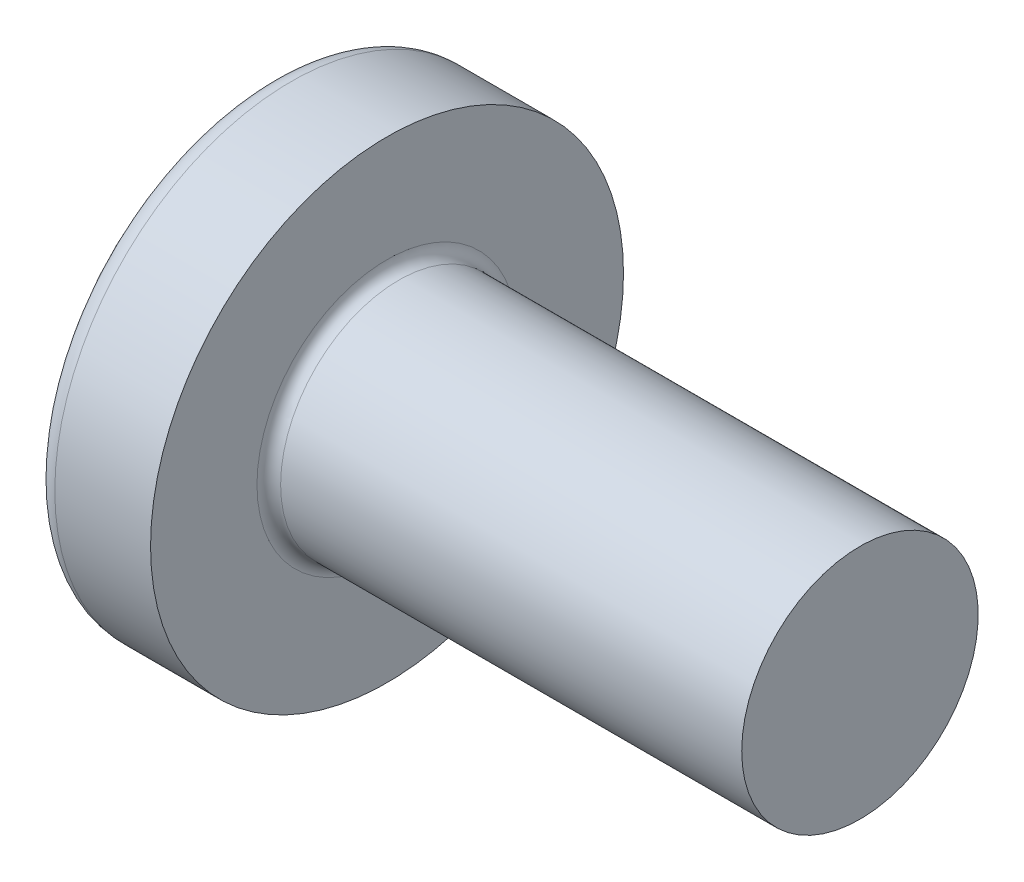
ISO-10303-21;
HEADER;
FILE_DESCRIPTION(('STEP AP214'),'2;1');
FILE_NAME('part.step','',(''),(''),'','','');
FILE_SCHEMA(('AUTOMOTIVE_DESIGN { 1 0 10303 214 1 1 1 1 }'));
ENDSEC;
DATA;
#1=APPLICATION_CONTEXT('core data for automotive mechanical design processes');
#2=APPLICATION_PROTOCOL_DEFINITION('international standard','automotive_design',2000,#1);
#3=PRODUCT_CONTEXT('',#1,'mechanical');
#4=PRODUCT('Part','Part','',(#3));
#5=PRODUCT_RELATED_PRODUCT_CATEGORY('part','',(#4));
#6=PRODUCT_DEFINITION_FORMATION('','',#4);
#7=PRODUCT_DEFINITION_CONTEXT('part definition',#1,'design');
#8=PRODUCT_DEFINITION('design','',#6,#7);
#9=PRODUCT_DEFINITION_SHAPE('','',#8);
#10=(LENGTH_UNIT() NAMED_UNIT(*) SI_UNIT(.MILLI.,.METRE.));
#11=(NAMED_UNIT(*) PLANE_ANGLE_UNIT() SI_UNIT($,.RADIAN.));
#12=(NAMED_UNIT(*) SI_UNIT($,.STERADIAN.) SOLID_ANGLE_UNIT());
#13=UNCERTAINTY_MEASURE_WITH_UNIT(LENGTH_MEASURE(1.E-05),#10,'distance_accuracy_value','');
#14=(GEOMETRIC_REPRESENTATION_CONTEXT(3) GLOBAL_UNCERTAINTY_ASSIGNED_CONTEXT((#13)) GLOBAL_UNIT_ASSIGNED_CONTEXT((#10,
#11,#12)) REPRESENTATION_CONTEXT('',''));
#15=CARTESIAN_POINT('',(0.,0.,0.));
#16=DIRECTION('',(0.,0.,1.));
#17=DIRECTION('',(1.,0.,0.));
#18=AXIS2_PLACEMENT_3D('',#15,#16,#17);
#19=CARTESIAN_POINT('',(-998.464491047989,0.,0.));
#20=DIRECTION('',(-1.,0.,0.));
#21=DIRECTION('',(0.,0.,1.));
#22=AXIS2_PLACEMENT_3D('',#19,#20,#21);
#23=CONICAL_SURFACE('',#22,3077.68353717531,1.25663706143592);
#24=CARTESIAN_POINT('',(1.42,0.,0.));
#25=DIRECTION('',(-1.,0.,0.));
#26=DIRECTION('',(0.,0.,1.));
#27=AXIS2_PLACEMENT_3D('',#24,#25,#26);
#28=CIRCLE('',#27,0.3555);
#29=CARTESIAN_POINT('',(1.42,-0.096987179996118,0.342014234961647));
#30=VERTEX_POINT('',#29);
#31=CARTESIAN_POINT('',(1.42,0.0969871799961156,0.342014234961648));
#32=VERTEX_POINT('',#31);
#33=EDGE_CURVE('E331',#30,#32,#28,.T.);
#34=ORIENTED_EDGE('',*,*,#33,.T.);
#35=CARTESIAN_POINT('',(1.42,0.,0.));
#36=DIRECTION('',(-1.,0.,0.));
#37=DIRECTION('',(0.,0.,1.));
#38=AXIS2_PLACEMENT_3D('',#35,#36,#37);
#39=CIRCLE('',#38,0.3555);
#40=CARTESIAN_POINT('',(1.42,0.239999999999999,0.26225989018529));
#41=VERTEX_POINT('',#40);
#42=EDGE_CURVE('E173',#32,#41,#39,.T.);
#43=ORIENTED_EDGE('',*,*,#42,.T.);
#44=CARTESIAN_POINT('',(1.42,0.,0.));
#45=DIRECTION('',(-1.,0.,0.));
#46=DIRECTION('',(0.,0.,1.));
#47=AXIS2_PLACEMENT_3D('',#44,#45,#46);
#48=CIRCLE('',#47,0.3555);
#49=CARTESIAN_POINT('',(1.42,0.262259890185289,0.24));
#50=VERTEX_POINT('',#49);
#51=EDGE_CURVE('E337',#41,#50,#48,.T.);
#52=ORIENTED_EDGE('',*,*,#51,.T.);
#53=CARTESIAN_POINT('',(1.42,0.,0.));
#54=DIRECTION('',(-1.,0.,0.));
#55=DIRECTION('',(0.,0.,1.));
#56=AXIS2_PLACEMENT_3D('',#53,#54,#55);
#57=CIRCLE('',#56,0.3555);
#58=CARTESIAN_POINT('',(1.42,0.342014234961648,0.0969871799961127));
#59=VERTEX_POINT('',#58);
#60=EDGE_CURVE('E366',#50,#59,#57,.T.);
#61=ORIENTED_EDGE('',*,*,#60,.T.);
#62=CARTESIAN_POINT('',(1.42,0.,0.));
#63=DIRECTION('',(-1.,0.,0.));
#64=DIRECTION('',(0.,0.,1.));
#65=AXIS2_PLACEMENT_3D('',#62,#63,#64);
#66=CIRCLE('',#65,0.3555);
#67=CARTESIAN_POINT('',(1.42,0.342014234961648,-0.0969871799961128));
#68=VERTEX_POINT('',#67);
#69=EDGE_CURVE('E371',#59,#68,#66,.T.);
#70=ORIENTED_EDGE('',*,*,#69,.T.);
#71=CARTESIAN_POINT('',(1.42,0.,0.));
#72=DIRECTION('',(-1.,0.,0.));
#73=DIRECTION('',(0.,0.,1.));
#74=AXIS2_PLACEMENT_3D('',#71,#72,#73);
#75=CIRCLE('',#74,0.3555);
#76=CARTESIAN_POINT('',(1.42,0.262259890185289,-0.24));
#77=VERTEX_POINT('',#76);
#78=EDGE_CURVE('E381',#68,#77,#75,.T.);
#79=ORIENTED_EDGE('',*,*,#78,.T.);
#80=CARTESIAN_POINT('',(1.42,0.,0.));
#81=DIRECTION('',(-1.,0.,0.));
#82=DIRECTION('',(0.,0.,1.));
#83=AXIS2_PLACEMENT_3D('',#80,#81,#82);
#84=CIRCLE('',#83,0.3555);
#85=CARTESIAN_POINT('',(1.42,0.240000000000001,-0.262259890185288));
#86=VERTEX_POINT('',#85);
#87=EDGE_CURVE('E323',#77,#86,#84,.T.);
#88=ORIENTED_EDGE('',*,*,#87,.T.);
#89=CARTESIAN_POINT('',(1.42,0.,0.));
#90=DIRECTION('',(-1.,0.,0.));
#91=DIRECTION('',(0.,0.,1.));
#92=AXIS2_PLACEMENT_3D('',#89,#90,#91);
#93=CIRCLE('',#92,0.3555);
#94=CARTESIAN_POINT('',(1.42,0.0969871799961165,-0.342014234961647));
#95=VERTEX_POINT('',#94);
#96=EDGE_CURVE('E320',#86,#95,#93,.T.);
#97=ORIENTED_EDGE('',*,*,#96,.T.);
#98=CARTESIAN_POINT('',(1.42,0.,0.));
#99=DIRECTION('',(-1.,0.,0.));
#100=DIRECTION('',(0.,0.,1.));
#101=AXIS2_PLACEMENT_3D('',#98,#99,#100);
#102=CIRCLE('',#101,0.3555);
#103=CARTESIAN_POINT('',(1.42,-0.0969871799961141,-0.342014234961648));
#104=VERTEX_POINT('',#103);
#105=EDGE_CURVE('E11',#95,#104,#102,.T.);
#106=ORIENTED_EDGE('',*,*,#105,.T.);
#107=CARTESIAN_POINT('',(1.42,0.,0.));
#108=DIRECTION('',(-1.,0.,0.));
#109=DIRECTION('',(0.,0.,1.));
#110=AXIS2_PLACEMENT_3D('',#107,#108,#109);
#111=CIRCLE('',#110,0.3555);
#112=CARTESIAN_POINT('',(1.42,-0.239999999999999,-0.26225989018529));
#113=VERTEX_POINT('',#112);
#114=EDGE_CURVE('E33',#104,#113,#111,.T.);
#115=ORIENTED_EDGE('',*,*,#114,.T.);
#116=CARTESIAN_POINT('',(1.42,0.,0.));
#117=DIRECTION('',(-1.,0.,0.));
#118=DIRECTION('',(0.,0.,1.));
#119=AXIS2_PLACEMENT_3D('',#116,#117,#118);
#120=CIRCLE('',#119,0.3555);
#121=CARTESIAN_POINT('',(1.42,-0.262259890185289,-0.24));
#122=VERTEX_POINT('',#121);
#123=EDGE_CURVE('E185',#113,#122,#120,.T.);
#124=ORIENTED_EDGE('',*,*,#123,.T.);
#125=CARTESIAN_POINT('',(1.42,0.,0.));
#126=DIRECTION('',(-1.,0.,0.));
#127=DIRECTION('',(0.,0.,1.));
#128=AXIS2_PLACEMENT_3D('',#125,#126,#127);
#129=CIRCLE('',#128,0.3555);
#130=CARTESIAN_POINT('',(1.42,-0.342014234961649,-0.0969871799961111));
#131=VERTEX_POINT('',#130);
#132=EDGE_CURVE('E374',#122,#131,#129,.T.);
#133=ORIENTED_EDGE('',*,*,#132,.T.);
#134=CARTESIAN_POINT('',(1.42,0.,0.));
#135=DIRECTION('',(-1.,0.,0.));
#136=DIRECTION('',(0.,0.,1.));
#137=AXIS2_PLACEMENT_3D('',#134,#135,#136);
#138=CIRCLE('',#137,0.3555);
#139=CARTESIAN_POINT('',(1.42,-0.342014234961649,0.096987179996111));
#140=VERTEX_POINT('',#139);
#141=EDGE_CURVE('E348',#131,#140,#138,.T.);
#142=ORIENTED_EDGE('',*,*,#141,.T.);
#143=CARTESIAN_POINT('',(1.42,0.,0.));
#144=DIRECTION('',(-1.,0.,0.));
#145=DIRECTION('',(0.,0.,1.));
#146=AXIS2_PLACEMENT_3D('',#143,#144,#145);
#147=CIRCLE('',#146,0.3555);
#148=CARTESIAN_POINT('',(1.42,-0.262259890185289,0.24));
#149=VERTEX_POINT('',#148);
#150=EDGE_CURVE('E345',#140,#149,#147,.T.);
#151=ORIENTED_EDGE('',*,*,#150,.T.);
#152=CARTESIAN_POINT('',(1.42,0.,0.));
#153=DIRECTION('',(-1.,0.,0.));
#154=DIRECTION('',(0.,0.,1.));
#155=AXIS2_PLACEMENT_3D('',#152,#153,#154);
#156=CIRCLE('',#155,0.3555);
#157=CARTESIAN_POINT('',(1.42,-0.240000000000001,0.262259890185288));
#158=VERTEX_POINT('',#157);
#159=EDGE_CURVE('E330',#149,#158,#156,.T.);
#160=ORIENTED_EDGE('',*,*,#159,.T.);
#161=CARTESIAN_POINT('',(1.42,0.,0.));
#162=DIRECTION('',(-1.,0.,0.));
#163=DIRECTION('',(0.,0.,1.));
#164=AXIS2_PLACEMENT_3D('',#161,#162,#163);
#165=CIRCLE('',#164,0.3555);
#166=EDGE_CURVE('E327',#158,#30,#165,.T.);
#167=ORIENTED_EDGE('',*,*,#166,.T.);
#168=EDGE_LOOP('',(#34,#43,#52,#61,#70,#79,#88,#97,#106,#115,#124,#133,#142,#151,#160,#167));
#169=FACE_BOUND('',#168,.T.);
#170=CARTESIAN_POINT('',(1.5355089520108,0.,0.));
#171=VERTEX_POINT('',#170);
#172=VERTEX_LOOP('',#171);
#173=FACE_BOUND('',#172,.T.);
#174=ADVANCED_FACE('F17',(#169,#173),#23,.F.);
#175=CARTESIAN_POINT('',(1.42,0.,0.));
#176=DIRECTION('',(-1.,0.,0.));
#177=DIRECTION('',(0.,0.,1.));
#178=AXIS2_PLACEMENT_3D('',#175,#176,#177);
#179=CONICAL_SURFACE('',#178,0.3555,0.069813170079766);
#180=CARTESIAN_POINT('',(1.38853932865354,0.,0.35769994444886));
#181=CARTESIAN_POINT('',(1.38853932865354,0.0330178274849108,0.35769994444886));
#182=CARTESIAN_POINT('',(1.39911491003058,0.0656203045040143,0.352427154961573));
#183=CARTESIAN_POINT('',(1.42,0.0969871799961156,0.342014234961648));
#184=(BOUNDED_CURVE() B_SPLINE_CURVE(3,(#180,#181,#182,#183),.UNSPECIFIED.,.F.,
.F.) B_SPLINE_CURVE_WITH_KNOTS((4,4),(0.,0.317566308934627),
.UNSPECIFIED.) CURVE() GEOMETRIC_REPRESENTATION_ITEM() RATIONAL_B_SPLINE_CURVE((1.,
0.991613612050471,0.991613612050471,1.)) REPRESENTATION_ITEM(''));
#185=CARTESIAN_POINT('',(1.38853932865354,0.,0.35769994444886));
#186=VERTEX_POINT('',#185);
#187=EDGE_CURVE('E469',#186,#32,#184,.T.);
#188=ORIENTED_EDGE('',*,*,#187,.T.);
#189=ORIENTED_EDGE('',*,*,#33,.F.);
#190=CARTESIAN_POINT('',(1.42,-0.096987179996118,0.342014234961647));
#191=CARTESIAN_POINT('',(1.39911491003058,-0.0656203045040168,0.352427154961572));
#192=CARTESIAN_POINT('',(1.38853932865354,-0.0330178274849133,0.35769994444886));
#193=CARTESIAN_POINT('',(1.38853932865354,0.,0.35769994444886));
#194=(BOUNDED_CURVE() B_SPLINE_CURVE(3,(#190,#191,#192,#193),.UNSPECIFIED.,.F.,
.F.) B_SPLINE_CURVE_WITH_KNOTS((4,4),(5.96561899824496,6.28318530717959),
.UNSPECIFIED.) CURVE() GEOMETRIC_REPRESENTATION_ITEM() RATIONAL_B_SPLINE_CURVE((1.,
0.991613612050471,0.991613612050471,1.)) REPRESENTATION_ITEM(''));
#195=EDGE_CURVE('E363',#30,#186,#194,.T.);
#196=ORIENTED_EDGE('',*,*,#195,.T.);
#197=EDGE_LOOP('',(#188,#189,#196));
#198=FACE_BOUND('',#197,.T.);
#199=ADVANCED_FACE('F511',(#198),#179,.F.);
#200=CARTESIAN_POINT('',(1.7,0.,0.));
#201=DIRECTION('',(-1.,0.,0.));
#202=DIRECTION('',(0.,0.,1.));
#203=AXIS2_PLACEMENT_3D('',#200,#201,#202);
#204=TOROIDAL_SURFACE('',#203,1.1,0.1);
#205=CARTESIAN_POINT('',(1.7,0.,0.));
#206=DIRECTION('',(1.,0.,0.));
#207=DIRECTION('',(0.,0.,1.));
#208=AXIS2_PLACEMENT_3D('',#205,#206,#207);
#209=CIRCLE('',#208,1.);
#210=CARTESIAN_POINT('',(1.7,0.,1.));
#211=VERTEX_POINT('',#210);
#212=EDGE_CURVE('E188',#211,#211,#209,.T.);
#213=ORIENTED_EDGE('',*,*,#212,.F.);
#214=EDGE_LOOP('',(#213));
#215=FACE_BOUND('',#214,.T.);
#216=CARTESIAN_POINT('',(1.6,0.,0.));
#217=DIRECTION('',(-1.,0.,0.));
#218=DIRECTION('',(0.,0.,1.));
#219=AXIS2_PLACEMENT_3D('',#216,#217,#218);
#220=CIRCLE('',#219,1.1);
#221=CARTESIAN_POINT('',(1.6,0.,1.1));
#222=VERTEX_POINT('',#221);
#223=EDGE_CURVE('E193',#222,#222,#220,.T.);
#224=ORIENTED_EDGE('',*,*,#223,.F.);
#225=EDGE_LOOP('',(#224));
#226=FACE_BOUND('',#225,.T.);
#227=ADVANCED_FACE('F567',(#215,#226),#204,.F.);
#228=CARTESIAN_POINT('',(0.79002074697727,0.,0.));
#229=DIRECTION('',(-1.,0.,0.));
#230=DIRECTION('',(0.,0.,1.));
#231=AXIS2_PLACEMENT_3D('',#228,#229,#230);
#232=TOROIDAL_SURFACE('',#231,1.82,0.18);
#233=CARTESIAN_POINT('',(0.646379599446113,0.,0.));
#234=DIRECTION('',(-1.,0.,0.));
#235=DIRECTION('',(0.,0.,1.));
#236=AXIS2_PLACEMENT_3D('',#233,#234,#235);
#237=CIRCLE('',#236,1.92847682119205);
#238=CARTESIAN_POINT('',(0.646379599446113,0.,1.92847682119205));
#239=VERTEX_POINT('',#238);
#240=EDGE_CURVE('E458',#239,#239,#237,.T.);
#241=ORIENTED_EDGE('',*,*,#240,.F.);
#242=EDGE_LOOP('',(#241));
#243=FACE_BOUND('',#242,.T.);
#244=CARTESIAN_POINT('',(0.790020746977271,0.,0.));
#245=DIRECTION('',(-1.,0.,0.));
#246=DIRECTION('',(0.,0.,1.));
#247=AXIS2_PLACEMENT_3D('',#244,#245,#246);
#248=CIRCLE('',#247,2.);
#249=CARTESIAN_POINT('',(0.790020746977271,0.,2.));
#250=VERTEX_POINT('',#249);
#251=EDGE_CURVE('E465',#250,#250,#248,.T.);
#252=ORIENTED_EDGE('',*,*,#251,.T.);
#253=EDGE_LOOP('',(#252));
#254=FACE_BOUND('',#253,.T.);
#255=ADVANCED_FACE('F572',(#243,#254),#232,.T.);
#256=CARTESIAN_POINT('',(-25.4,0.,0.));
#257=DIRECTION('',(-1.,0.,0.));
#258=DIRECTION('',(0.,0.,1.));
#259=AXIS2_PLACEMENT_3D('',#256,#257,#258);
#260=CYLINDRICAL_SURFACE('',#259,2.);
#261=ORIENTED_EDGE('',*,*,#251,.F.);
#262=EDGE_LOOP('',(#261));
#263=FACE_BOUND('',#262,.T.);
#264=CARTESIAN_POINT('',(1.6,0.,0.));
#265=DIRECTION('',(-1.,0.,0.));
#266=DIRECTION('',(0.,0.,1.));
#267=AXIS2_PLACEMENT_3D('',#264,#265,#266);
#268=CIRCLE('',#267,2.);
#269=CARTESIAN_POINT('',(1.6,0.,2.));
#270=VERTEX_POINT('',#269);
#271=EDGE_CURVE('E462',#270,#270,#268,.T.);
#272=ORIENTED_EDGE('',*,*,#271,.T.);
#273=EDGE_LOOP('',(#272));
#274=FACE_BOUND('',#273,.T.);
#275=ADVANCED_FACE('F576',(#263,#274),#260,.T.);
#276=CARTESIAN_POINT('',(-25.4,0.,0.));
#277=DIRECTION('',(-1.,0.,0.));
#278=DIRECTION('',(0.,0.,1.));
#279=AXIS2_PLACEMENT_3D('',#276,#277,#278);
#280=CYLINDRICAL_SURFACE('',#279,1.);
#281=ORIENTED_EDGE('',*,*,#212,.T.);
#282=EDGE_LOOP('',(#281));
#283=FACE_BOUND('',#282,.T.);
#284=CARTESIAN_POINT('',(5.6,0.,0.));
#285=DIRECTION('',(-1.,0.,0.));
#286=DIRECTION('',(0.,0.,1.));
#287=AXIS2_PLACEMENT_3D('',#284,#285,#286);
#288=CIRCLE('',#287,1.);
#289=CARTESIAN_POINT('',(5.6,0.,1.));
#290=VERTEX_POINT('',#289);
#291=EDGE_CURVE('E459',#290,#290,#288,.T.);
#292=ORIENTED_EDGE('',*,*,#291,.T.);
#293=EDGE_LOOP('',(#292));
#294=FACE_BOUND('',#293,.T.);
#295=ADVANCED_FACE('F579',(#283,#294),#280,.T.);
#296=CARTESIAN_POINT('',(3.2,0.,0.));
#297=DIRECTION('',(0.,0.,-1.));
#298=DIRECTION('',(0.,1.,0.));
#299=AXIS2_PLACEMENT_3D('',#296,#297,#298);
#300=SPHERICAL_SURFACE('',#299,3.2);
#301=CARTESIAN_POINT('',(2.98218780828175,-0.436863744320003,0.));
#302=DIRECTION('',(0.446197753347436,0.894934391398443,0.));
#303=DIRECTION('',(-0.894934391398443,0.446197753347436,0.));
#304=AXIS2_PLACEMENT_3D('',#301,#302,#303);
#305=CIRCLE('',#304,3.16254769419176);
#306=CARTESIAN_POINT('',(0.160076673366104,0.970188728128243,-0.24));
#307=VERTEX_POINT('',#306);
#308=CARTESIAN_POINT('',(0.160076673366104,0.970188728128243,0.24));
#309=VERTEX_POINT('',#308);
#310=EDGE_CURVE('E452',#307,#309,#305,.T.);
#311=ORIENTED_EDGE('',*,*,#310,.T.);
#312=CARTESIAN_POINT('',(3.2,0.,0.24));
#313=DIRECTION('',(0.,0.,-1.));
#314=DIRECTION('',(0.,1.,0.));
#315=AXIS2_PLACEMENT_3D('',#312,#313,#314);
#316=CIRCLE('',#315,3.19098730802866);
#317=CARTESIAN_POINT('',(0.0321614467928854,0.383665089387417,0.24));
#318=VERTEX_POINT('',#317);
#319=EDGE_CURVE('E246',#318,#309,#316,.T.);
#320=ORIENTED_EDGE('',*,*,#319,.F.);
#321=CARTESIAN_POINT('',(0.0321614467928854,0.,0.));
#322=DIRECTION('',(-1.,0.,0.));
#323=DIRECTION('',(0.,0.,-1.));
#324=AXIS2_PLACEMENT_3D('',#321,#322,#323);
#325=CIRCLE('',#324,0.452547125518057);
#326=CARTESIAN_POINT('',(0.0321614467928856,0.239999999999999,0.383665089387419));
#327=VERTEX_POINT('',#326);
#328=EDGE_CURVE('E360',#327,#318,#325,.T.);
#329=ORIENTED_EDGE('',*,*,#328,.F.);
#330=CARTESIAN_POINT('',(3.2,0.24,0.));
#331=DIRECTION('',(0.,-1.,0.));
#332=DIRECTION('',(0.,0.,-1.));
#333=AXIS2_PLACEMENT_3D('',#330,#331,#332);
#334=CIRCLE('',#333,3.19098730802866);
#335=CARTESIAN_POINT('',(0.160076673366103,0.239999999999997,0.970188728128244));
#336=VERTEX_POINT('',#335);
#337=EDGE_CURVE('E271',#336,#327,#334,.T.);
#338=ORIENTED_EDGE('',*,*,#337,.F.);
#339=CARTESIAN_POINT('',(2.98218780828175,0.,-0.436863744320003));
#340=DIRECTION('',(0.446197753347436,0.,0.894934391398443));
#341=DIRECTION('',(0.894934391398443,0.,-0.446197753347436));
#342=AXIS2_PLACEMENT_3D('',#339,#340,#341);
#343=CIRCLE('',#342,3.16254769419176);
#344=CARTESIAN_POINT('',(0.160076673366103,-0.240000000000003,0.970188728128242));
#345=VERTEX_POINT('',#344);
#346=EDGE_CURVE('E387',#336,#345,#343,.T.);
#347=ORIENTED_EDGE('',*,*,#346,.T.);
#348=CARTESIAN_POINT('',(3.2,-0.24,0.));
#349=DIRECTION('',(0.,1.,0.));
#350=DIRECTION('',(0.,0.,1.));
#351=AXIS2_PLACEMENT_3D('',#348,#349,#350);
#352=CIRCLE('',#351,3.19098730802866);
#353=CARTESIAN_POINT('',(0.0321614467928854,-0.240000000000001,0.383665089387418));
#354=VERTEX_POINT('',#353);
#355=EDGE_CURVE('E324',#354,#345,#352,.T.);
#356=ORIENTED_EDGE('',*,*,#355,.F.);
#357=CARTESIAN_POINT('',(0.0321614467928854,0.,0.));
#358=DIRECTION('',(-1.,0.,0.));
#359=DIRECTION('',(0.,0.,-1.));
#360=AXIS2_PLACEMENT_3D('',#357,#358,#359);
#361=CIRCLE('',#360,0.452547125518057);
#362=CARTESIAN_POINT('',(0.0321614467928854,-0.383665089387419,0.24));
#363=VERTEX_POINT('',#362);
#364=EDGE_CURVE('E355',#363,#354,#361,.T.);
#365=ORIENTED_EDGE('',*,*,#364,.F.);
#366=CARTESIAN_POINT('',(3.2,0.,0.24));
#367=DIRECTION('',(0.,0.,-1.));
#368=DIRECTION('',(0.,1.,0.));
#369=AXIS2_PLACEMENT_3D('',#366,#367,#368);
#370=CIRCLE('',#369,3.19098730802866);
#371=CARTESIAN_POINT('',(0.160076673366103,-0.970188728128243,0.24));
#372=VERTEX_POINT('',#371);
#373=EDGE_CURVE('E351',#372,#363,#370,.T.);
#374=ORIENTED_EDGE('',*,*,#373,.F.);
#375=CARTESIAN_POINT('',(2.98218780828175,0.436863744320002,0.));
#376=DIRECTION('',(0.446197753347436,-0.894934391398443,0.));
#377=DIRECTION('',(0.894934391398443,0.446197753347436,0.));
#378=AXIS2_PLACEMENT_3D('',#375,#376,#377);
#379=CIRCLE('',#378,3.16254769419176);
#380=CARTESIAN_POINT('',(0.160076673366103,-0.970188728128243,-0.24));
#381=VERTEX_POINT('',#380);
#382=EDGE_CURVE('E456',#372,#381,#379,.T.);
#383=ORIENTED_EDGE('',*,*,#382,.T.);
#384=CARTESIAN_POINT('',(3.2,0.,-0.24));
#385=DIRECTION('',(0.,0.,1.));
#386=DIRECTION('',(1.,0.,0.));
#387=AXIS2_PLACEMENT_3D('',#384,#385,#386);
#388=CIRCLE('',#387,3.19098730802866);
#389=CARTESIAN_POINT('',(0.0321614467928855,-0.383665089387419,-0.24));
#390=VERTEX_POINT('',#389);
#391=EDGE_CURVE('E167',#390,#381,#388,.T.);
#392=ORIENTED_EDGE('',*,*,#391,.F.);
#393=CARTESIAN_POINT('',(0.0321614467928854,0.,0.));
#394=DIRECTION('',(-1.,0.,0.));
#395=DIRECTION('',(0.,0.,-1.));
#396=AXIS2_PLACEMENT_3D('',#393,#394,#395);
#397=CIRCLE('',#396,0.452547125518057);
#398=CARTESIAN_POINT('',(0.0321614467928854,-0.239999999999998,-0.38366508938742));
#399=VERTEX_POINT('',#398);
#400=EDGE_CURVE('E159',#399,#390,#397,.T.);
#401=ORIENTED_EDGE('',*,*,#400,.F.);
#402=CARTESIAN_POINT('',(3.2,-0.24,0.));
#403=DIRECTION('',(0.,1.,0.));
#404=DIRECTION('',(0.,0.,1.));
#405=AXIS2_PLACEMENT_3D('',#402,#403,#404);
#406=CIRCLE('',#405,3.19098730802866);
#407=CARTESIAN_POINT('',(0.160076673366103,-0.239999999999996,-0.970188728128244));
#408=VERTEX_POINT('',#407);
#409=EDGE_CURVE('E164',#408,#399,#406,.T.);
#410=ORIENTED_EDGE('',*,*,#409,.F.);
#411=CARTESIAN_POINT('',(2.98218780828175,0.,0.436863744320002));
#412=DIRECTION('',(0.446197753347436,0.,-0.894934391398443));
#413=DIRECTION('',(-0.894934391398443,0.,-0.446197753347436));
#414=AXIS2_PLACEMENT_3D('',#411,#412,#413);
#415=CIRCLE('',#414,3.16254769419176);
#416=CARTESIAN_POINT('',(0.160076673366103,0.240000000000003,-0.970188728128242));
#417=VERTEX_POINT('',#416);
#418=EDGE_CURVE('E454',#408,#417,#415,.T.);
#419=ORIENTED_EDGE('',*,*,#418,.T.);
#420=CARTESIAN_POINT('',(3.2,0.24,0.));
#421=DIRECTION('',(0.,-1.,0.));
#422=DIRECTION('',(0.,0.,-1.));
#423=AXIS2_PLACEMENT_3D('',#420,#421,#422);
#424=CIRCLE('',#423,3.19098730802866);
#425=CARTESIAN_POINT('',(0.0321614467928854,0.240000000000001,-0.383665089387417));
#426=VERTEX_POINT('',#425);
#427=EDGE_CURVE('E312',#426,#417,#424,.T.);
#428=ORIENTED_EDGE('',*,*,#427,.F.);
#429=CARTESIAN_POINT('',(0.0321614467928854,0.,0.));
#430=DIRECTION('',(-1.,0.,0.));
#431=DIRECTION('',(0.,0.,-1.));
#432=AXIS2_PLACEMENT_3D('',#429,#430,#431);
#433=CIRCLE('',#432,0.452547125518057);
#434=CARTESIAN_POINT('',(0.0321614467928855,0.383665089387417,-0.24));
#435=VERTEX_POINT('',#434);
#436=EDGE_CURVE('E172',#435,#426,#433,.T.);
#437=ORIENTED_EDGE('',*,*,#436,.F.);
#438=CARTESIAN_POINT('',(3.2,0.,-0.24));
#439=DIRECTION('',(0.,0.,1.));
#440=DIRECTION('',(1.,0.,0.));
#441=AXIS2_PLACEMENT_3D('',#438,#439,#440);
#442=CIRCLE('',#441,3.19098730802866);
#443=EDGE_CURVE('E206',#307,#435,#442,.T.);
#444=ORIENTED_EDGE('',*,*,#443,.F.);
#445=EDGE_LOOP('',(#311,#320,#329,#338,#347,#356,#365,#374,#383,#392,#401,#410,#419,#428,#437,#444));
#446=FACE_BOUND('',#445,.T.);
#447=ORIENTED_EDGE('',*,*,#240,.T.);
#448=EDGE_LOOP('',(#447));
#449=FACE_BOUND('',#448,.T.);
#450=ADVANCED_FACE('F161',(#446,#449),#300,.T.);
#451=CARTESIAN_POINT('',(1.42,0.342014234961647,-0.24));
#452=DIRECTION('',(0.,0.,1.));
#453=DIRECTION('',(1.,0.,0.));
#454=AXIS2_PLACEMENT_3D('',#451,#452,#453);
#455=PLANE('',#454);
#456=ORIENTED_EDGE('',*,*,#443,.T.);
#457=CARTESIAN_POINT('',(0.0321614467928856,0.383665089387419,-0.24));
#458=CARTESIAN_POINT('',(0.172697148295828,0.372064034597807,-0.24));
#459=CARTESIAN_POINT('',(0.31322263072474,0.360333952815257,-0.24));
#460=CARTESIAN_POINT('',(0.594238285905824,0.336477810254577,-0.24));
#461=CARTESIAN_POINT('',(0.734728459045723,0.32435175403485,-0.24));
#462=CARTESIAN_POINT('',(0.966019988502869,0.303945294942453,-0.24));
#463=CARTESIAN_POINT('',(1.05683500418333,0.295820311839184,-0.24));
#464=CARTESIAN_POINT('',(1.23843898471245,0.279277294107898,-0.24));
#465=CARTESIAN_POINT('',(1.32922794936196,0.270859257296756,-0.24));
#466=CARTESIAN_POINT('',(1.42000000000038,0.262259890189613,-0.24));
#467=B_SPLINE_CURVE_WITH_KNOTS('',3,(#457,#458,#459,#460,#461,#462,#463,#464,#465,#466),
.UNSPECIFIED.,.F.,.F.,(4,2,2,2,4),(0.,0.423041758824321,0.846078649367109,1.11961147507105,
1.39314633891277),.UNSPECIFIED.);
#468=EDGE_CURVE('E198',#435,#77,#467,.T.);
#469=ORIENTED_EDGE('',*,*,#468,.T.);
#470=DIRECTION('',(0.,1.,0.));
#471=VECTOR('',#470,1.);
#472=CARTESIAN_POINT('',(1.42,-0.342014234961648,-0.24));
#473=LINE('',#472,#471);
#474=CARTESIAN_POINT('',(1.42,0.342014234961647,-0.24));
#475=VERTEX_POINT('',#474);
#476=EDGE_CURVE('E207',#77,#475,#473,.T.);
#477=ORIENTED_EDGE('',*,*,#476,.T.);
#478=DIRECTION('',(0.894934391398443,-0.446197753347436,0.));
#479=VECTOR('',#478,1.);
#480=CARTESIAN_POINT('',(0.,1.05,-0.24));
#481=LINE('',#480,#479);
#482=EDGE_CURVE('E344',#307,#475,#481,.T.);
#483=ORIENTED_EDGE('',*,*,#482,.F.);
#484=EDGE_LOOP('',(#456,#469,#477,#483));
#485=FACE_BOUND('',#484,.T.);
#486=ADVANCED_FACE('F218',(#485),#455,.T.);
#487=CARTESIAN_POINT('',(1.42,0.342014234961647,-0.24));
#488=DIRECTION('',(0.,0.,1.));
#489=DIRECTION('',(1.,0.,0.));
#490=AXIS2_PLACEMENT_3D('',#487,#488,#489);
#491=PLANE('',#490);
#492=DIRECTION('',(0.,1.,0.));
#493=VECTOR('',#492,1.);
#494=CARTESIAN_POINT('',(1.42,-0.342014234961648,-0.24));
#495=LINE('',#494,#493);
#496=CARTESIAN_POINT('',(1.42,-0.342014234961648,-0.24));
#497=VERTEX_POINT('',#496);
#498=EDGE_CURVE('E377',#497,#122,#495,.T.);
#499=ORIENTED_EDGE('',*,*,#498,.T.);
#500=CARTESIAN_POINT('',(1.42,-0.262259890185289,-0.24));
#501=CARTESIAN_POINT('',(1.30971853065584,-0.272703075674253,-0.24));
#502=CARTESIAN_POINT('',(1.19941281358894,-0.282885058269453,-0.24));
#503=CARTESIAN_POINT('',(0.978765100191391,-0.302838125702782,-0.24));
#504=CARTESIAN_POINT('',(0.868423104177938,-0.312609214041997,-0.24));
#505=CARTESIAN_POINT('',(0.637110468042188,-0.332776589226817,-0.24));
#506=CARTESIAN_POINT('',(0.516137215605676,-0.34314274696763,-0.24));
#507=CARTESIAN_POINT('',(0.274165845085653,-0.36359458144025,-0.24));
#508=CARTESIAN_POINT('',(0.153167726782289,-0.373680255574267,-0.24));
#509=CARTESIAN_POINT('',(0.0321614467929333,-0.383665089387968,-0.24));
#510=B_SPLINE_CURVE_WITH_KNOTS('',3,(#500,#501,#502,#503,#504,#505,#506,#507,#508,#509),
.UNSPECIFIED.,.F.,.F.,(4,2,2,2,4),(0.,0.33232348147274,0.664644130760303,1.02889353261038,
1.39314630695263),.UNSPECIFIED.);
#511=EDGE_CURVE('E208',#122,#390,#510,.T.);
#512=ORIENTED_EDGE('',*,*,#511,.T.);
#513=ORIENTED_EDGE('',*,*,#391,.T.);
#514=DIRECTION('',(0.894934391398443,0.446197753347436,0.));
#515=VECTOR('',#514,1.);
#516=CARTESIAN_POINT('',(0.,-1.05,-0.24));
#517=LINE('',#516,#515);
#518=EDGE_CURVE('E369',#381,#497,#517,.T.);
#519=ORIENTED_EDGE('',*,*,#518,.T.);
#520=EDGE_LOOP('',(#499,#512,#513,#519));
#521=FACE_BOUND('',#520,.T.);
#522=ADVANCED_FACE('F222',(#521),#491,.T.);
#523=CARTESIAN_POINT('',(1.42,-0.342014234961647,0.24));
#524=DIRECTION('',(0.,0.,-1.));
#525=DIRECTION('',(0.,1.,0.));
#526=AXIS2_PLACEMENT_3D('',#523,#524,#525);
#527=PLANE('',#526);
#528=DIRECTION('',(0.,-1.,0.));
#529=VECTOR('',#528,1.);
#530=CARTESIAN_POINT('',(1.42,0.342014234961647,0.24));
#531=LINE('',#530,#529);
#532=CARTESIAN_POINT('',(1.42,0.342014234961647,0.24));
#533=VERTEX_POINT('',#532);
#534=EDGE_CURVE('E245',#533,#50,#531,.T.);
#535=ORIENTED_EDGE('',*,*,#534,.T.);
#536=CARTESIAN_POINT('',(1.42,0.262259890185289,0.24));
#537=CARTESIAN_POINT('',(1.30971853065584,0.272703075674253,0.24));
#538=CARTESIAN_POINT('',(1.19941281358894,0.282885058269453,0.24));
#539=CARTESIAN_POINT('',(0.978765100191391,0.302838125702782,0.24));
#540=CARTESIAN_POINT('',(0.868423104177938,0.312609214041997,0.24));
#541=CARTESIAN_POINT('',(0.637110468042189,0.332776589226817,0.24));
#542=CARTESIAN_POINT('',(0.516137215605676,0.34314274696763,0.24));
#543=CARTESIAN_POINT('',(0.274165845085654,0.36359458144025,0.24));
#544=CARTESIAN_POINT('',(0.153167726782289,0.373680255574267,0.24));
#545=CARTESIAN_POINT('',(0.0321614467929339,0.383665089387968,0.24));
#546=B_SPLINE_CURVE_WITH_KNOTS('',3,(#536,#537,#538,#539,#540,#541,#542,#543,#544,#545),
.UNSPECIFIED.,.F.,.F.,(4,2,2,2,4),(0.,0.33232348147274,0.664644130760303,1.02889353261038,
1.39314630695263),.UNSPECIFIED.);
#547=EDGE_CURVE('E237',#50,#318,#546,.T.);
#548=ORIENTED_EDGE('',*,*,#547,.T.);
#549=ORIENTED_EDGE('',*,*,#319,.T.);
#550=DIRECTION('',(0.894934391398443,-0.446197753347436,0.));
#551=VECTOR('',#550,1.);
#552=CARTESIAN_POINT('',(0.,1.05,0.24));
#553=LINE('',#552,#551);
#554=EDGE_CURVE('E354',#309,#533,#553,.T.);
#555=ORIENTED_EDGE('',*,*,#554,.T.);
#556=EDGE_LOOP('',(#535,#548,#549,#555));
#557=FACE_BOUND('',#556,.T.);
#558=ADVANCED_FACE('F228',(#557),#527,.T.);
#559=CARTESIAN_POINT('',(1.42,-0.342014234961647,0.24));
#560=DIRECTION('',(0.,0.,-1.));
#561=DIRECTION('',(0.,1.,0.));
#562=AXIS2_PLACEMENT_3D('',#559,#560,#561);
#563=PLANE('',#562);
#564=ORIENTED_EDGE('',*,*,#373,.T.);
#565=CARTESIAN_POINT('',(0.0321614467928858,-0.383665089387419,0.24));
#566=CARTESIAN_POINT('',(0.172697148295829,-0.372064034597807,0.24));
#567=CARTESIAN_POINT('',(0.31322263072474,-0.360333952815257,0.24));
#568=CARTESIAN_POINT('',(0.594238285905824,-0.336477810254577,0.24));
#569=CARTESIAN_POINT('',(0.734728459045723,-0.32435175403485,0.24));
#570=CARTESIAN_POINT('',(0.966019988502869,-0.303945294942453,0.24));
#571=CARTESIAN_POINT('',(1.05683500418333,-0.295820311839184,0.24));
#572=CARTESIAN_POINT('',(1.23843898471245,-0.279277294107898,0.24));
#573=CARTESIAN_POINT('',(1.32922794936196,-0.270859257296756,0.24));
#574=CARTESIAN_POINT('',(1.42000000000038,-0.262259890189614,0.24));
#575=B_SPLINE_CURVE_WITH_KNOTS('',3,(#565,#566,#567,#568,#569,#570,#571,#572,#573,#574),
.UNSPECIFIED.,.F.,.F.,(4,2,2,2,4),(0.,0.423041758824321,0.846078649367109,1.11961147507105,
1.39314633891277),.UNSPECIFIED.);
#576=EDGE_CURVE('E247',#363,#149,#575,.T.);
#577=ORIENTED_EDGE('',*,*,#576,.T.);
#578=DIRECTION('',(0.,-1.,0.));
#579=VECTOR('',#578,1.);
#580=CARTESIAN_POINT('',(1.42,0.342014234961647,0.24));
#581=LINE('',#580,#579);
#582=CARTESIAN_POINT('',(1.42,-0.342014234961648,0.24));
#583=VERTEX_POINT('',#582);
#584=EDGE_CURVE('E341',#149,#583,#581,.T.);
#585=ORIENTED_EDGE('',*,*,#584,.T.);
#586=DIRECTION('',(0.894934391398443,0.446197753347436,0.));
#587=VECTOR('',#586,1.);
#588=CARTESIAN_POINT('',(0.,-1.05,0.24));
#589=LINE('',#588,#587);
#590=EDGE_CURVE('E423',#372,#583,#589,.T.);
#591=ORIENTED_EDGE('',*,*,#590,.F.);
#592=EDGE_LOOP('',(#564,#577,#585,#591));
#593=FACE_BOUND('',#592,.T.);
#594=ADVANCED_FACE('F233',(#593),#563,.T.);
#595=CARTESIAN_POINT('',(0.,1.05,0.24));
#596=DIRECTION('',(0.446197753347436,0.894934391398443,0.));
#597=DIRECTION('',(-0.894934391398443,0.446197753347436,0.));
#598=AXIS2_PLACEMENT_3D('',#595,#596,#597);
#599=PLANE('',#598);
#600=CARTESIAN_POINT('',(1.42,0.342014234961648,0.0969871799961127));
#601=CARTESIAN_POINT('',(1.37769080755671,0.363108816637784,0.0334438975164538));
#602=CARTESIAN_POINT('',(1.37769080755671,0.363108816637784,-0.033443897516454));
#603=CARTESIAN_POINT('',(1.42,0.342014234961648,-0.0969871799961128));
#604=(BOUNDED_CURVE() B_SPLINE_CURVE(3,(#600,#601,#602,#603),.UNSPECIFIED.,.F.,
.F.) B_SPLINE_CURVE_WITH_KNOTS((4,4),(5.96561899824497,6.6007516161142),
.UNSPECIFIED.) CURVE() GEOMETRIC_REPRESENTATION_ITEM() RATIONAL_B_SPLINE_CURVE((1.,
0.966665442710408,0.966665442710408,1.)) REPRESENTATION_ITEM(''));
#605=EDGE_CURVE('E403',#59,#68,#604,.T.);
#606=ORIENTED_EDGE('',*,*,#605,.F.);
#607=DIRECTION('',(0.,0.,-1.));
#608=VECTOR('',#607,1.);
#609=CARTESIAN_POINT('',(1.42,0.342014234961647,0.24));
#610=LINE('',#609,#608);
#611=EDGE_CURVE('E340',#533,#59,#610,.T.);
#612=ORIENTED_EDGE('',*,*,#611,.F.);
#613=ORIENTED_EDGE('',*,*,#554,.F.);
#614=ORIENTED_EDGE('',*,*,#310,.F.);
#615=ORIENTED_EDGE('',*,*,#482,.T.);
#616=DIRECTION('',(0.,0.,-1.));
#617=VECTOR('',#616,1.);
#618=CARTESIAN_POINT('',(1.42,0.342014234961647,0.24));
#619=LINE('',#618,#617);
#620=EDGE_CURVE('E418',#68,#475,#619,.T.);
#621=ORIENTED_EDGE('',*,*,#620,.F.);
#622=EDGE_LOOP('',(#606,#612,#613,#614,#615,#621));
#623=FACE_BOUND('',#622,.T.);
#624=ADVANCED_FACE('F527',(#623),#599,.F.);
#625=CARTESIAN_POINT('',(0.,-1.05,-0.24));
#626=DIRECTION('',(0.446197753347436,-0.894934391398443,0.));
#627=DIRECTION('',(0.894934391398443,0.446197753347436,0.));
#628=AXIS2_PLACEMENT_3D('',#625,#626,#627);
#629=PLANE('',#628);
#630=CARTESIAN_POINT('',(1.42,-0.342014234961649,-0.0969871799961111));
#631=CARTESIAN_POINT('',(1.37769080755671,-0.363108816637784,-0.0334438975164533));
#632=CARTESIAN_POINT('',(1.37769080755671,-0.363108816637784,0.0334438975164532));
#633=CARTESIAN_POINT('',(1.42,-0.342014234961649,0.096987179996111));
#634=(BOUNDED_CURVE() B_SPLINE_CURVE(3,(#630,#631,#632,#633),.UNSPECIFIED.,.F.,
.F.) B_SPLINE_CURVE_WITH_KNOTS((4,4),(5.96561899824498,6.60075161611419),
.UNSPECIFIED.) CURVE() GEOMETRIC_REPRESENTATION_ITEM() RATIONAL_B_SPLINE_CURVE((1.,
0.966665442710409,0.966665442710409,1.)) REPRESENTATION_ITEM(''));
#635=EDGE_CURVE('E362',#131,#140,#634,.T.);
#636=ORIENTED_EDGE('',*,*,#635,.F.);
#637=DIRECTION('',(0.,0.,1.));
#638=VECTOR('',#637,1.);
#639=CARTESIAN_POINT('',(1.42,-0.342014234961648,-0.24));
#640=LINE('',#639,#638);
#641=EDGE_CURVE('E420',#497,#131,#640,.T.);
#642=ORIENTED_EDGE('',*,*,#641,.F.);
#643=ORIENTED_EDGE('',*,*,#518,.F.);
#644=ORIENTED_EDGE('',*,*,#382,.F.);
#645=ORIENTED_EDGE('',*,*,#590,.T.);
#646=DIRECTION('',(0.,0.,1.));
#647=VECTOR('',#646,1.);
#648=CARTESIAN_POINT('',(1.42,-0.342014234961648,-0.24));
#649=LINE('',#648,#647);
#650=EDGE_CURVE('E424',#140,#583,#649,.T.);
#651=ORIENTED_EDGE('',*,*,#650,.F.);
#652=EDGE_LOOP('',(#636,#642,#643,#644,#645,#651));
#653=FACE_BOUND('',#652,.T.);
#654=ADVANCED_FACE('F490',(#653),#629,.F.);
#655=CARTESIAN_POINT('',(1.42,0.342014234961647,-0.24));
#656=DIRECTION('',(-1.,0.,0.));
#657=DIRECTION('',(0.,0.,1.));
#658=AXIS2_PLACEMENT_3D('',#655,#656,#657);
#659=PLANE('',#658);
#660=DIRECTION('',(0.,1.,0.));
#661=VECTOR('',#660,1.);
#662=CARTESIAN_POINT('',(1.42,-0.240000000000001,0.342014234961646));
#663=LINE('',#662,#661);
#664=CARTESIAN_POINT('',(1.42,-0.240000000000001,0.342014234961646));
#665=VERTEX_POINT('',#664);
#666=EDGE_CURVE('E421',#665,#30,#663,.T.);
#667=ORIENTED_EDGE('',*,*,#666,.T.);
#668=ORIENTED_EDGE('',*,*,#166,.F.);
#669=DIRECTION('',(0.,0.,-1.));
#670=VECTOR('',#669,1.);
#671=CARTESIAN_POINT('',(1.42,-0.240000000000001,0.342014234961646));
#672=LINE('',#671,#670);
#673=EDGE_CURVE('E332',#665,#158,#672,.T.);
#674=ORIENTED_EDGE('',*,*,#673,.F.);
#675=EDGE_LOOP('',(#667,#668,#674));
#676=FACE_BOUND('',#675,.T.);
#677=ADVANCED_FACE('F551',(#676),#659,.T.);
#678=CARTESIAN_POINT('',(1.42,0.342014234961647,-0.24));
#679=DIRECTION('',(-1.,0.,0.));
#680=DIRECTION('',(0.,0.,1.));
#681=AXIS2_PLACEMENT_3D('',#678,#679,#680);
#682=PLANE('',#681);
#683=ORIENTED_EDGE('',*,*,#584,.F.);
#684=ORIENTED_EDGE('',*,*,#150,.F.);
#685=ORIENTED_EDGE('',*,*,#650,.T.);
#686=EDGE_LOOP('',(#683,#684,#685));
#687=FACE_BOUND('',#686,.T.);
#688=ADVANCED_FACE('F494',(#687),#682,.T.);
#689=CARTESIAN_POINT('',(1.42,0.342014234961647,-0.24));
#690=DIRECTION('',(-1.,0.,0.));
#691=DIRECTION('',(0.,0.,1.));
#692=AXIS2_PLACEMENT_3D('',#689,#690,#691);
#693=PLANE('',#692);
#694=ORIENTED_EDGE('',*,*,#641,.T.);
#695=ORIENTED_EDGE('',*,*,#132,.F.);
#696=ORIENTED_EDGE('',*,*,#498,.F.);
#697=EDGE_LOOP('',(#694,#695,#696));
#698=FACE_BOUND('',#697,.T.);
#699=ADVANCED_FACE('F559',(#698),#693,.T.);
#700=CARTESIAN_POINT('',(1.42,0.342014234961647,-0.24));
#701=DIRECTION('',(-1.,0.,0.));
#702=DIRECTION('',(0.,0.,1.));
#703=AXIS2_PLACEMENT_3D('',#700,#701,#702);
#704=PLANE('',#703);
#705=DIRECTION('',(0.,0.,-1.));
#706=VECTOR('',#705,1.);
#707=CARTESIAN_POINT('',(1.42,-0.240000000000001,0.342014234961646));
#708=LINE('',#707,#706);
#709=CARTESIAN_POINT('',(1.42,-0.239999999999999,-0.342014234961648));
#710=VERTEX_POINT('',#709);
#711=EDGE_CURVE('E187',#113,#710,#708,.T.);
#712=ORIENTED_EDGE('',*,*,#711,.F.);
#713=ORIENTED_EDGE('',*,*,#114,.F.);
#714=DIRECTION('',(0.,-1.,0.));
#715=VECTOR('',#714,1.);
#716=CARTESIAN_POINT('',(1.42,0.240000000000001,-0.342014234961647));
#717=LINE('',#716,#715);
#718=EDGE_CURVE('E417',#104,#710,#717,.T.);
#719=ORIENTED_EDGE('',*,*,#718,.T.);
#720=EDGE_LOOP('',(#712,#713,#719));
#721=FACE_BOUND('',#720,.T.);
#722=ADVANCED_FACE('F547',(#721),#704,.T.);
#723=CARTESIAN_POINT('',(1.42,0.342014234961647,-0.24));
#724=DIRECTION('',(-1.,0.,0.));
#725=DIRECTION('',(0.,0.,1.));
#726=AXIS2_PLACEMENT_3D('',#723,#724,#725);
#727=PLANE('',#726);
#728=DIRECTION('',(0.,-1.,0.));
#729=VECTOR('',#728,1.);
#730=CARTESIAN_POINT('',(1.42,0.240000000000001,-0.342014234961647));
#731=LINE('',#730,#729);
#732=CARTESIAN_POINT('',(1.42,0.240000000000001,-0.342014234961647));
#733=VERTEX_POINT('',#732);
#734=EDGE_CURVE('E414',#733,#95,#731,.T.);
#735=ORIENTED_EDGE('',*,*,#734,.T.);
#736=ORIENTED_EDGE('',*,*,#96,.F.);
#737=DIRECTION('',(0.,0.,1.));
#738=VECTOR('',#737,1.);
#739=CARTESIAN_POINT('',(1.42,0.240000000000001,-0.342014234961647));
#740=LINE('',#739,#738);
#741=EDGE_CURVE('E311',#733,#86,#740,.T.);
#742=ORIENTED_EDGE('',*,*,#741,.F.);
#743=EDGE_LOOP('',(#735,#736,#742));
#744=FACE_BOUND('',#743,.T.);
#745=ADVANCED_FACE('F542',(#744),#727,.T.);
#746=CARTESIAN_POINT('',(1.42,0.342014234961647,-0.24));
#747=DIRECTION('',(-1.,0.,0.));
#748=DIRECTION('',(0.,0.,1.));
#749=AXIS2_PLACEMENT_3D('',#746,#747,#748);
#750=PLANE('',#749);
#751=ORIENTED_EDGE('',*,*,#476,.F.);
#752=ORIENTED_EDGE('',*,*,#78,.F.);
#753=ORIENTED_EDGE('',*,*,#620,.T.);
#754=EDGE_LOOP('',(#751,#752,#753));
#755=FACE_BOUND('',#754,.T.);
#756=ADVANCED_FACE('F535',(#755),#750,.T.);
#757=CARTESIAN_POINT('',(1.42,0.342014234961647,-0.24));
#758=DIRECTION('',(-1.,0.,0.));
#759=DIRECTION('',(0.,0.,1.));
#760=AXIS2_PLACEMENT_3D('',#757,#758,#759);
#761=PLANE('',#760);
#762=ORIENTED_EDGE('',*,*,#611,.T.);
#763=ORIENTED_EDGE('',*,*,#60,.F.);
#764=ORIENTED_EDGE('',*,*,#534,.F.);
#765=EDGE_LOOP('',(#762,#763,#764));
#766=FACE_BOUND('',#765,.T.);
#767=ADVANCED_FACE('F284',(#766),#761,.T.);
#768=CARTESIAN_POINT('',(1.42,0.239999999999999,0.342014234961648));
#769=DIRECTION('',(0.,-1.,0.));
#770=DIRECTION('',(1.,0.,0.));
#771=AXIS2_PLACEMENT_3D('',#768,#769,#770);
#772=PLANE('',#771);
#773=ORIENTED_EDGE('',*,*,#337,.T.);
#774=CARTESIAN_POINT('',(0.0321614467928857,0.239999999999999,0.38366508938742));
#775=CARTESIAN_POINT('',(0.172697148295829,0.239999999999999,0.372064034597808));
#776=CARTESIAN_POINT('',(0.31322263072474,0.239999999999999,0.360333952815258));
#777=CARTESIAN_POINT('',(0.594238285905824,0.239999999999999,0.336477810254578));
#778=CARTESIAN_POINT('',(0.734728459045723,0.239999999999999,0.32435175403485));
#779=CARTESIAN_POINT('',(0.966019988502869,0.239999999999999,0.303945294942454));
#780=CARTESIAN_POINT('',(1.05683500418333,0.239999999999999,0.295820311839185));
#781=CARTESIAN_POINT('',(1.23843898471245,0.239999999999999,0.279277294107899));
#782=CARTESIAN_POINT('',(1.32922794936196,0.239999999999999,0.270859257296757));
#783=CARTESIAN_POINT('',(1.42000000000038,0.239999999999999,0.262259890189614));
#784=B_SPLINE_CURVE_WITH_KNOTS('',3,(#774,#775,#776,#777,#778,#779,#780,#781,#782,#783),
.UNSPECIFIED.,.F.,.F.,(4,2,2,2,4),(0.,0.423041758824321,0.846078649367109,1.11961147507105,
1.39314633891277),.UNSPECIFIED.);
#785=EDGE_CURVE('E263',#327,#41,#784,.T.);
#786=ORIENTED_EDGE('',*,*,#785,.T.);
#787=DIRECTION('',(0.,0.,1.));
#788=VECTOR('',#787,1.);
#789=CARTESIAN_POINT('',(1.42,0.240000000000001,-0.342014234961647));
#790=LINE('',#789,#788);
#791=CARTESIAN_POINT('',(1.42,0.239999999999999,0.342014234961648));
#792=VERTEX_POINT('',#791);
#793=EDGE_CURVE('E272',#41,#792,#790,.T.);
#794=ORIENTED_EDGE('',*,*,#793,.T.);
#795=DIRECTION('',(0.894934391398443,0.,-0.446197753347436));
#796=VECTOR('',#795,1.);
#797=CARTESIAN_POINT('',(0.,0.239999999999996,1.05));
#798=LINE('',#797,#796);
#799=EDGE_CURVE('E391',#336,#792,#798,.T.);
#800=ORIENTED_EDGE('',*,*,#799,.F.);
#801=EDGE_LOOP('',(#773,#786,#794,#800));
#802=FACE_BOUND('',#801,.T.);
#803=ADVANCED_FACE('F279',(#802),#772,.T.);
#804=CARTESIAN_POINT('',(1.42,-0.239999999999999,-0.342014234961648));
#805=DIRECTION('',(0.,1.,0.));
#806=DIRECTION('',(0.,0.,1.));
#807=AXIS2_PLACEMENT_3D('',#804,#805,#806);
#808=PLANE('',#807);
#809=ORIENTED_EDGE('',*,*,#673,.T.);
#810=CARTESIAN_POINT('',(1.42,-0.240000000000001,0.262259890185288));
#811=CARTESIAN_POINT('',(1.30971853065584,-0.240000000000001,0.272703075674252));
#812=CARTESIAN_POINT('',(1.19941281358894,-0.240000000000001,0.282885058269452));
#813=CARTESIAN_POINT('',(0.978765100191391,-0.240000000000001,0.302838125702782));
#814=CARTESIAN_POINT('',(0.868423104177938,-0.240000000000001,0.312609214041996));
#815=CARTESIAN_POINT('',(0.637110468042188,-0.240000000000001,0.332776589226816));
#816=CARTESIAN_POINT('',(0.516137215605676,-0.240000000000001,0.343142746967629));
#817=CARTESIAN_POINT('',(0.274165845085654,-0.240000000000001,0.363594581440249));
#818=CARTESIAN_POINT('',(0.15316772678229,-0.240000000000001,0.373680255574266));
#819=CARTESIAN_POINT('',(0.032161446792934,-0.240000000000001,0.383665089387967));
#820=B_SPLINE_CURVE_WITH_KNOTS('',3,(#810,#811,#812,#813,#814,#815,#816,#817,#818,#819),
.UNSPECIFIED.,.F.,.F.,(4,2,2,2,4),(0.,0.33232348147274,0.664644130760303,1.02889353261038,
1.39314630695263),.UNSPECIFIED.);
#821=EDGE_CURVE('E273',#158,#354,#820,.T.);
#822=ORIENTED_EDGE('',*,*,#821,.T.);
#823=ORIENTED_EDGE('',*,*,#355,.T.);
#824=DIRECTION('',(0.894934391398443,0.,-0.446197753347436));
#825=VECTOR('',#824,1.);
#826=CARTESIAN_POINT('',(0.,-0.240000000000004,1.05));
#827=LINE('',#826,#825);
#828=EDGE_CURVE('E326',#345,#665,#827,.T.);
#829=ORIENTED_EDGE('',*,*,#828,.T.);
#830=EDGE_LOOP('',(#809,#822,#823,#829));
#831=FACE_BOUND('',#830,.T.);
#832=ADVANCED_FACE('F283',(#831),#808,.T.);
#833=CARTESIAN_POINT('',(0.,-0.240000000000004,1.05));
#834=DIRECTION('',(0.446197753347436,0.,0.894934391398443));
#835=DIRECTION('',(-0.894934391398443,0.,0.446197753347436));
#836=AXIS2_PLACEMENT_3D('',#833,#834,#835);
#837=PLANE('',#836);
#838=ORIENTED_EDGE('',*,*,#195,.F.);
#839=ORIENTED_EDGE('',*,*,#666,.F.);
#840=ORIENTED_EDGE('',*,*,#828,.F.);
#841=ORIENTED_EDGE('',*,*,#346,.F.);
#842=ORIENTED_EDGE('',*,*,#799,.T.);
#843=DIRECTION('',(0.,1.,0.));
#844=VECTOR('',#843,1.);
#845=CARTESIAN_POINT('',(1.42,-0.240000000000001,0.342014234961646));
#846=LINE('',#845,#844);
#847=EDGE_CURVE('E397',#32,#792,#846,.T.);
#848=ORIENTED_EDGE('',*,*,#847,.F.);
#849=ORIENTED_EDGE('',*,*,#187,.F.);
#850=EDGE_LOOP('',(#838,#839,#840,#841,#842,#848,#849));
#851=FACE_BOUND('',#850,.T.);
#852=ADVANCED_FACE('F290',(#851),#837,.F.);
#853=CARTESIAN_POINT('',(0.,0.240000000000004,-1.05));
#854=DIRECTION('',(0.446197753347436,0.,-0.894934391398443));
#855=DIRECTION('',(0.894934391398443,0.,0.446197753347436));
#856=AXIS2_PLACEMENT_3D('',#853,#854,#855);
#857=PLANE('',#856);
#858=CARTESIAN_POINT('',(1.42,0.0969871799961165,-0.342014234961647));
#859=CARTESIAN_POINT('',(1.37769080755671,0.033443897516456,-0.363108816637785));
#860=CARTESIAN_POINT('',(1.37769080755671,-0.0334438975164534,-0.363108816637785));
#861=CARTESIAN_POINT('',(1.42,-0.0969871799961141,-0.342014234961648));
#862=(BOUNDED_CURVE() B_SPLINE_CURVE(3,(#858,#859,#860,#861),.UNSPECIFIED.,.F.,
.F.) B_SPLINE_CURVE_WITH_KNOTS((4,4),(5.96561899824496,6.60075161611421),
.UNSPECIFIED.) CURVE() GEOMETRIC_REPRESENTATION_ITEM() RATIONAL_B_SPLINE_CURVE((1.,
0.966665442710406,0.966665442710406,1.)) REPRESENTATION_ITEM(''));
#863=EDGE_CURVE('E357',#95,#104,#862,.T.);
#864=ORIENTED_EDGE('',*,*,#863,.F.);
#865=ORIENTED_EDGE('',*,*,#734,.F.);
#866=DIRECTION('',(0.894934391398443,0.,0.446197753347436));
#867=VECTOR('',#866,1.);
#868=CARTESIAN_POINT('',(0.,0.240000000000004,-1.05));
#869=LINE('',#868,#867);
#870=EDGE_CURVE('E181',#417,#733,#869,.T.);
#871=ORIENTED_EDGE('',*,*,#870,.F.);
#872=ORIENTED_EDGE('',*,*,#418,.F.);
#873=DIRECTION('',(0.894934391398443,0.,0.446197753347436));
#874=VECTOR('',#873,1.);
#875=CARTESIAN_POINT('',(0.,-0.239999999999996,-1.05));
#876=LINE('',#875,#874);
#877=EDGE_CURVE('E180',#408,#710,#876,.T.);
#878=ORIENTED_EDGE('',*,*,#877,.T.);
#879=ORIENTED_EDGE('',*,*,#718,.F.);
#880=EDGE_LOOP('',(#864,#865,#871,#872,#878,#879));
#881=FACE_BOUND('',#880,.T.);
#882=ADVANCED_FACE('F294',(#881),#857,.F.);
#883=CARTESIAN_POINT('',(1.42,0.239999999999999,0.342014234961648));
#884=DIRECTION('',(0.,-1.,0.));
#885=DIRECTION('',(1.,0.,0.));
#886=AXIS2_PLACEMENT_3D('',#883,#884,#885);
#887=PLANE('',#886);
#888=ORIENTED_EDGE('',*,*,#741,.T.);
#889=CARTESIAN_POINT('',(1.42,0.240000000000001,-0.262259890185288));
#890=CARTESIAN_POINT('',(1.30971853065584,0.240000000000001,-0.272703075674252));
#891=CARTESIAN_POINT('',(1.19941281358894,0.240000000000001,-0.282885058269452));
#892=CARTESIAN_POINT('',(0.978765100191391,0.240000000000001,-0.302838125702781));
#893=CARTESIAN_POINT('',(0.868423104177938,0.240000000000001,-0.312609214041996));
#894=CARTESIAN_POINT('',(0.637110468042188,0.240000000000001,-0.332776589226816));
#895=CARTESIAN_POINT('',(0.516137215605676,0.240000000000001,-0.343142746967629));
#896=CARTESIAN_POINT('',(0.274165845085653,0.240000000000001,-0.363594581440249));
#897=CARTESIAN_POINT('',(0.153167726782289,0.240000000000001,-0.373680255574266));
#898=CARTESIAN_POINT('',(0.0321614467929335,0.240000000000001,-0.383665089387967));
#899=B_SPLINE_CURVE_WITH_KNOTS('',3,(#889,#890,#891,#892,#893,#894,#895,#896,#897,#898),
.UNSPECIFIED.,.F.,.F.,(4,2,2,2,4),(0.,0.33232348147274,0.664644130760303,1.02889353261038,
1.39314630695263),.UNSPECIFIED.);
#900=EDGE_CURVE('E305',#86,#426,#899,.T.);
#901=ORIENTED_EDGE('',*,*,#900,.T.);
#902=ORIENTED_EDGE('',*,*,#427,.T.);
#903=ORIENTED_EDGE('',*,*,#870,.T.);
#904=EDGE_LOOP('',(#888,#901,#902,#903));
#905=FACE_BOUND('',#904,.T.);
#906=ADVANCED_FACE('F298',(#905),#887,.T.);
#907=CARTESIAN_POINT('',(1.42,-0.239999999999999,-0.342014234961648));
#908=DIRECTION('',(0.,1.,0.));
#909=DIRECTION('',(0.,0.,1.));
#910=AXIS2_PLACEMENT_3D('',#907,#908,#909);
#911=PLANE('',#910);
#912=ORIENTED_EDGE('',*,*,#409,.T.);
#913=CARTESIAN_POINT('',(0.0321614467928861,-0.239999999999998,-0.38366508938742));
#914=CARTESIAN_POINT('',(0.172697148295829,-0.239999999999998,-0.372064034597808));
#915=CARTESIAN_POINT('',(0.313222630724741,-0.239999999999999,-0.360333952815258));
#916=CARTESIAN_POINT('',(0.594238285905824,-0.239999999999999,-0.336477810254578));
#917=CARTESIAN_POINT('',(0.734728459045723,-0.239999999999999,-0.324351754034851));
#918=CARTESIAN_POINT('',(0.966019988502869,-0.239999999999999,-0.303945294942454));
#919=CARTESIAN_POINT('',(1.05683500418333,-0.239999999999999,-0.295820311839185));
#920=CARTESIAN_POINT('',(1.23843898471245,-0.239999999999999,-0.279277294107899));
#921=CARTESIAN_POINT('',(1.32922794936196,-0.239999999999999,-0.270859257296757));
#922=CARTESIAN_POINT('',(1.42000000000038,-0.239999999999999,-0.262259890189614));
#923=B_SPLINE_CURVE_WITH_KNOTS('',3,(#913,#914,#915,#916,#917,#918,#919,#920,#921,#922),
.UNSPECIFIED.,.F.,.F.,(4,2,2,2,4),(0.,0.423041758824321,0.846078649367109,1.11961147507105,
1.39314633891277),.UNSPECIFIED.);
#924=EDGE_CURVE('E22',#399,#113,#923,.T.);
#925=ORIENTED_EDGE('',*,*,#924,.T.);
#926=ORIENTED_EDGE('',*,*,#711,.T.);
#927=ORIENTED_EDGE('',*,*,#877,.F.);
#928=EDGE_LOOP('',(#912,#925,#926,#927));
#929=FACE_BOUND('',#928,.T.);
#930=ADVANCED_FACE('F178',(#929),#911,.T.);
#931=CARTESIAN_POINT('',(1.6,1.,0.));
#932=DIRECTION('',(-1.,0.,0.));
#933=DIRECTION('',(0.,0.,1.));
#934=AXIS2_PLACEMENT_3D('',#931,#932,#933);
#935=PLANE('',#934);
#936=ORIENTED_EDGE('',*,*,#223,.T.);
#937=EDGE_LOOP('',(#936));
#938=FACE_BOUND('',#937,.T.);
#939=ORIENTED_EDGE('',*,*,#271,.F.);
#940=EDGE_LOOP('',(#939));
#941=FACE_BOUND('',#940,.T.);
#942=ADVANCED_FACE('F592',(#938,#941),#935,.F.);
#943=CARTESIAN_POINT('',(5.6,1.,0.));
#944=DIRECTION('',(1.,0.,0.));
#945=DIRECTION('',(0.,0.,-1.));
#946=AXIS2_PLACEMENT_3D('',#943,#944,#945);
#947=PLANE('',#946);
#948=ORIENTED_EDGE('',*,*,#291,.F.);
#949=EDGE_LOOP('',(#948));
#950=FACE_BOUND('',#949,.T.);
#951=ADVANCED_FACE('F590',(#950),#947,.T.);
#952=CARTESIAN_POINT('',(1.42,0.342014234961647,-0.24));
#953=DIRECTION('',(-1.,0.,0.));
#954=DIRECTION('',(0.,0.,1.));
#955=AXIS2_PLACEMENT_3D('',#952,#953,#954);
#956=PLANE('',#955);
#957=ORIENTED_EDGE('',*,*,#793,.F.);
#958=ORIENTED_EDGE('',*,*,#42,.F.);
#959=ORIENTED_EDGE('',*,*,#847,.T.);
#960=EDGE_LOOP('',(#957,#958,#959));
#961=FACE_BOUND('',#960,.T.);
#962=ADVANCED_FACE('F515',(#961),#956,.T.);
#963=CARTESIAN_POINT('',(1.42,0.,0.));
#964=DIRECTION('',(-1.,0.,0.));
#965=DIRECTION('',(0.,0.,1.));
#966=AXIS2_PLACEMENT_3D('',#963,#964,#965);
#967=CONICAL_SURFACE('',#966,0.3555,0.069813170079766);
#968=ORIENTED_EDGE('',*,*,#605,.T.);
#969=ORIENTED_EDGE('',*,*,#69,.F.);
#970=EDGE_LOOP('',(#968,#969));
#971=FACE_BOUND('',#970,.T.);
#972=ADVANCED_FACE('F531',(#971),#967,.F.);
#973=CARTESIAN_POINT('',(1.42,0.,0.));
#974=DIRECTION('',(-1.,0.,0.));
#975=DIRECTION('',(0.,0.,1.));
#976=AXIS2_PLACEMENT_3D('',#973,#974,#975);
#977=CONICAL_SURFACE('',#976,0.3555,0.069813170079766);
#978=ORIENTED_EDGE('',*,*,#635,.T.);
#979=ORIENTED_EDGE('',*,*,#141,.F.);
#980=EDGE_LOOP('',(#978,#979));
#981=FACE_BOUND('',#980,.T.);
#982=ADVANCED_FACE('F259',(#981),#977,.F.);
#983=CARTESIAN_POINT('',(1.42,0.,0.));
#984=DIRECTION('',(-1.,0.,0.));
#985=DIRECTION('',(0.,0.,1.));
#986=AXIS2_PLACEMENT_3D('',#983,#984,#985);
#987=CONICAL_SURFACE('',#986,0.3555,0.069813170079766);
#988=ORIENTED_EDGE('',*,*,#51,.F.);
#989=ORIENTED_EDGE('',*,*,#785,.F.);
#990=ORIENTED_EDGE('',*,*,#328,.T.);
#991=ORIENTED_EDGE('',*,*,#547,.F.);
#992=EDGE_LOOP('',(#988,#989,#990,#991));
#993=FACE_BOUND('',#992,.T.);
#994=ADVANCED_FACE('F253',(#993),#987,.F.);
#995=CARTESIAN_POINT('',(1.42,0.,0.));
#996=DIRECTION('',(-1.,0.,0.));
#997=DIRECTION('',(0.,0.,1.));
#998=AXIS2_PLACEMENT_3D('',#995,#996,#997);
#999=CONICAL_SURFACE('',#998,0.3555,0.069813170079766);
#1000=ORIENTED_EDGE('',*,*,#863,.T.);
#1001=ORIENTED_EDGE('',*,*,#105,.F.);
#1002=EDGE_LOOP('',(#1000,#1001));
#1003=FACE_BOUND('',#1002,.T.);
#1004=ADVANCED_FACE('F258',(#1003),#999,.F.);
#1005=CARTESIAN_POINT('',(1.42,0.,0.));
#1006=DIRECTION('',(-1.,0.,0.));
#1007=DIRECTION('',(0.,0.,1.));
#1008=AXIS2_PLACEMENT_3D('',#1005,#1006,#1007);
#1009=CONICAL_SURFACE('',#1008,0.3555,0.069813170079766);
#1010=ORIENTED_EDGE('',*,*,#364,.T.);
#1011=ORIENTED_EDGE('',*,*,#821,.F.);
#1012=ORIENTED_EDGE('',*,*,#159,.F.);
#1013=ORIENTED_EDGE('',*,*,#576,.F.);
#1014=EDGE_LOOP('',(#1010,#1011,#1012,#1013));
#1015=FACE_BOUND('',#1014,.T.);
#1016=ADVANCED_FACE('F501',(#1015),#1009,.F.);
#1017=CARTESIAN_POINT('',(1.42,0.,0.));
#1018=DIRECTION('',(-1.,0.,0.));
#1019=DIRECTION('',(0.,0.,1.));
#1020=AXIS2_PLACEMENT_3D('',#1017,#1018,#1019);
#1021=CONICAL_SURFACE('',#1020,0.3555,0.069813170079766);
#1022=ORIENTED_EDGE('',*,*,#436,.T.);
#1023=ORIENTED_EDGE('',*,*,#900,.F.);
#1024=ORIENTED_EDGE('',*,*,#87,.F.);
#1025=ORIENTED_EDGE('',*,*,#468,.F.);
#1026=EDGE_LOOP('',(#1022,#1023,#1024,#1025));
#1027=FACE_BOUND('',#1026,.T.);
#1028=ADVANCED_FACE('F215',(#1027),#1021,.F.);
#1029=CARTESIAN_POINT('',(1.42,0.,0.));
#1030=DIRECTION('',(-1.,0.,0.));
#1031=DIRECTION('',(0.,0.,1.));
#1032=AXIS2_PLACEMENT_3D('',#1029,#1030,#1031);
#1033=CONICAL_SURFACE('',#1032,0.3555,0.069813170079766);
#1034=ORIENTED_EDGE('',*,*,#123,.F.);
#1035=ORIENTED_EDGE('',*,*,#924,.F.);
#1036=ORIENTED_EDGE('',*,*,#400,.T.);
#1037=ORIENTED_EDGE('',*,*,#511,.F.);
#1038=EDGE_LOOP('',(#1034,#1035,#1036,#1037));
#1039=FACE_BOUND('',#1038,.T.);
#1040=ADVANCED_FACE('F19',(#1039),#1033,.F.);
#1041=CLOSED_SHELL('',(#174,#199,#227,#255,#275,#295,#450,#486,#522,#558,#594,#624,#654,#677,
#688,#699,#722,#745,#756,#767,#803,#832,#852,#882,#906,#930,#942,#951,#962,#972,#982,#994,#1004,
#1016,#1028,#1040));
#1042=MANIFOLD_SOLID_BREP('B1',#1041);
#1043=ADVANCED_BREP_SHAPE_REPRESENTATION('',(#18,#1042),#14);
#1044=SHAPE_DEFINITION_REPRESENTATION(#9,#1043);
ENDSEC;
END-ISO-10303-21;
